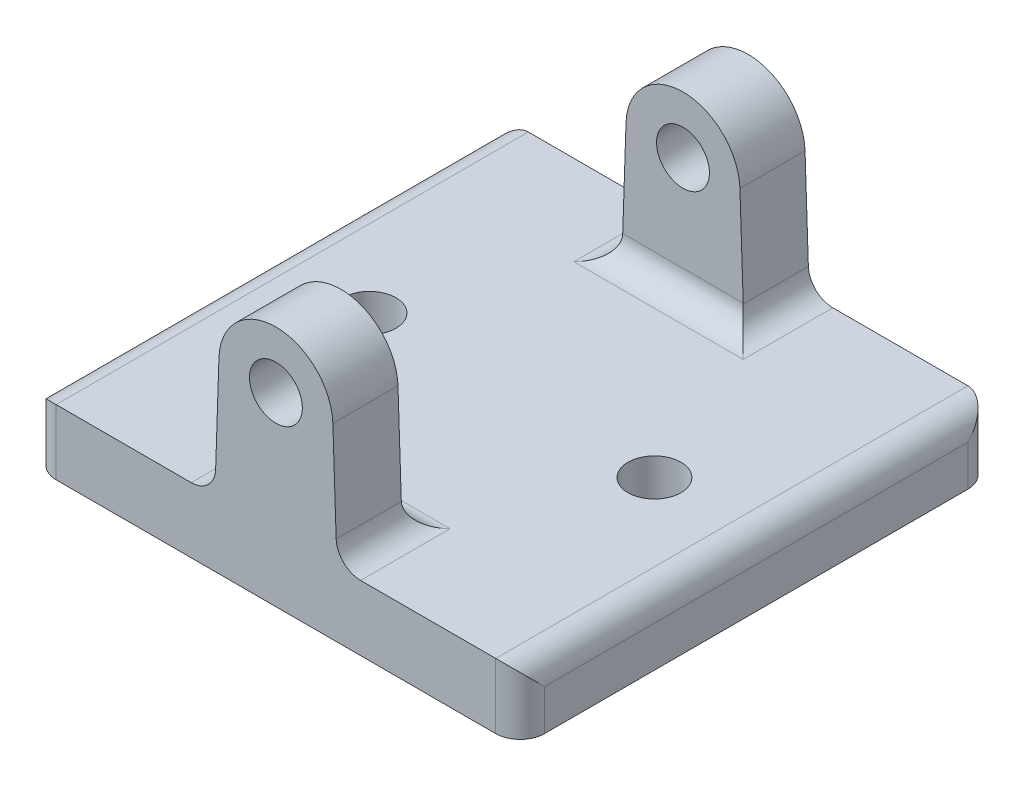
ISO-10303-21;
HEADER;
FILE_DESCRIPTION(('STEP AP214'),'2;1');
FILE_NAME('part.step','',(''),(''),'','','');
FILE_SCHEMA(('AUTOMOTIVE_DESIGN { 1 0 10303 214 1 1 1 1 }'));
ENDSEC;
DATA;
#1=APPLICATION_CONTEXT('core data for automotive mechanical design processes');
#2=APPLICATION_PROTOCOL_DEFINITION('international standard','automotive_design',2000,#1);
#3=PRODUCT_CONTEXT('',#1,'mechanical');
#4=PRODUCT('Part','Part','',(#3));
#5=PRODUCT_RELATED_PRODUCT_CATEGORY('part','',(#4));
#6=PRODUCT_DEFINITION_FORMATION('','',#4);
#7=PRODUCT_DEFINITION_CONTEXT('part definition',#1,'design');
#8=PRODUCT_DEFINITION('design','',#6,#7);
#9=PRODUCT_DEFINITION_SHAPE('','',#8);
#10=(LENGTH_UNIT() NAMED_UNIT(*) SI_UNIT(.MILLI.,.METRE.));
#11=(NAMED_UNIT(*) PLANE_ANGLE_UNIT() SI_UNIT($,.RADIAN.));
#12=(NAMED_UNIT(*) SI_UNIT($,.STERADIAN.) SOLID_ANGLE_UNIT());
#13=UNCERTAINTY_MEASURE_WITH_UNIT(LENGTH_MEASURE(1.E-05),#10,'distance_accuracy_value','');
#14=(GEOMETRIC_REPRESENTATION_CONTEXT(3) GLOBAL_UNCERTAINTY_ASSIGNED_CONTEXT((#13)) GLOBAL_UNIT_ASSIGNED_CONTEXT((#10,
#11,#12)) REPRESENTATION_CONTEXT('',''));
#15=CARTESIAN_POINT('',(0.,0.,0.));
#16=DIRECTION('',(0.,0.,1.));
#17=DIRECTION('',(1.,0.,0.));
#18=AXIS2_PLACEMENT_3D('',#15,#16,#17);
#19=CARTESIAN_POINT('',(0.,8.,0.));
#20=DIRECTION('',(0.,-1.,0.));
#21=DIRECTION('',(0.,0.,-1.));
#22=AXIS2_PLACEMENT_3D('',#19,#20,#21);
#23=PLANE('',#22);
#24=CARTESIAN_POINT('',(-17.5,8.,0.));
#25=DIRECTION('',(0.,1.,0.));
#26=DIRECTION('',(0.,0.,1.));
#27=AXIS2_PLACEMENT_3D('',#24,#25,#26);
#28=CIRCLE('',#27,3.25);
#29=CARTESIAN_POINT('',(-17.5,8.,3.25));
#30=VERTEX_POINT('',#29);
#31=EDGE_CURVE('E286',#30,#30,#28,.T.);
#32=ORIENTED_EDGE('',*,*,#31,.F.);
#33=EDGE_LOOP('',(#32));
#34=FACE_BOUND('',#33,.T.);
#35=CARTESIAN_POINT('',(17.5,8.,0.));
#36=DIRECTION('',(0.,1.,0.));
#37=DIRECTION('',(0.,0.,-1.));
#38=AXIS2_PLACEMENT_3D('',#35,#36,#37);
#39=CIRCLE('',#38,3.25);
#40=CARTESIAN_POINT('',(17.5,8.,-3.25));
#41=VERTEX_POINT('',#40);
#42=EDGE_CURVE('E278',#41,#41,#39,.T.);
#43=ORIENTED_EDGE('',*,*,#42,.F.);
#44=EDGE_LOOP('',(#43));
#45=FACE_BOUND('',#44,.T.);
#46=DIRECTION('',(1.,0.,0.));
#47=VECTOR('',#46,1.);
#48=CARTESIAN_POINT('',(-30.,8.,29.));
#49=LINE('',#48,#47);
#50=CARTESIAN_POINT('',(-27.,8.,29.));
#51=VERTEX_POINT('',#50);
#52=CARTESIAN_POINT('',(-10.4009031694853,8.,29.));
#53=VERTEX_POINT('',#52);
#54=EDGE_CURVE('E300',#51,#53,#49,.T.);
#55=ORIENTED_EDGE('',*,*,#54,.T.);
#56=DIRECTION('',(0.,0.,1.));
#57=VECTOR('',#56,1.);
#58=CARTESIAN_POINT('',(-10.4009031694853,8.,0.));
#59=LINE('',#58,#57);
#60=CARTESIAN_POINT('',(-10.4009031694853,8.,18.));
#61=VERTEX_POINT('',#60);
#62=EDGE_CURVE('E388',#53,#61,#59,.F.);
#63=ORIENTED_EDGE('',*,*,#62,.T.);
#64=DIRECTION('',(1.,0.,0.));
#65=VECTOR('',#64,1.);
#66=CARTESIAN_POINT('',(0.,8.,18.));
#67=LINE('',#66,#65);
#68=CARTESIAN_POINT('',(10.4009031694853,8.,18.));
#69=VERTEX_POINT('',#68);
#70=EDGE_CURVE('E384',#61,#69,#67,.T.);
#71=ORIENTED_EDGE('',*,*,#70,.T.);
#72=DIRECTION('',(0.,0.,1.));
#73=VECTOR('',#72,1.);
#74=CARTESIAN_POINT('',(10.4009031694853,8.,0.));
#75=LINE('',#74,#73);
#76=CARTESIAN_POINT('',(10.4009031694853,8.,29.));
#77=VERTEX_POINT('',#76);
#78=EDGE_CURVE('E381',#69,#77,#75,.T.);
#79=ORIENTED_EDGE('',*,*,#78,.T.);
#80=CARTESIAN_POINT('',(27.,8.,29.));
#81=VERTEX_POINT('',#80);
#82=EDGE_CURVE('E298',#77,#81,#49,.T.);
#83=ORIENTED_EDGE('',*,*,#82,.T.);
#84=DIRECTION('',(0.,0.,-1.));
#85=VECTOR('',#84,1.);
#86=CARTESIAN_POINT('',(27.,8.,0.));
#87=LINE('',#86,#85);
#88=CARTESIAN_POINT('',(27.,8.,-29.));
#89=VERTEX_POINT('',#88);
#90=EDGE_CURVE('E366',#81,#89,#87,.T.);
#91=ORIENTED_EDGE('',*,*,#90,.T.);
#92=DIRECTION('',(-1.,0.,0.));
#93=VECTOR('',#92,1.);
#94=CARTESIAN_POINT('',(-30.,8.,-29.));
#95=LINE('',#94,#93);
#96=CARTESIAN_POINT('',(10.4009031694853,8.,-29.));
#97=VERTEX_POINT('',#96);
#98=EDGE_CURVE('E294',#89,#97,#95,.T.);
#99=ORIENTED_EDGE('',*,*,#98,.T.);
#100=DIRECTION('',(0.,0.,-1.));
#101=VECTOR('',#100,1.);
#102=CARTESIAN_POINT('',(10.4009031694853,8.,-21.));
#103=LINE('',#102,#101);
#104=CARTESIAN_POINT('',(10.4009031694853,8.,-18.));
#105=VERTEX_POINT('',#104);
#106=EDGE_CURVE('E372',#97,#105,#103,.F.);
#107=ORIENTED_EDGE('',*,*,#106,.T.);
#108=DIRECTION('',(1.,0.,0.));
#109=VECTOR('',#108,1.);
#110=CARTESIAN_POINT('',(0.,8.,-18.));
#111=LINE('',#110,#109);
#112=CARTESIAN_POINT('',(-10.4009031694853,8.,-18.));
#113=VERTEX_POINT('',#112);
#114=EDGE_CURVE('E375',#105,#113,#111,.F.);
#115=ORIENTED_EDGE('',*,*,#114,.T.);
#116=DIRECTION('',(0.,0.,-1.));
#117=VECTOR('',#116,1.);
#118=CARTESIAN_POINT('',(-10.4009031694853,8.,-29.));
#119=LINE('',#118,#117);
#120=CARTESIAN_POINT('',(-10.4009031694853,8.,-29.));
#121=VERTEX_POINT('',#120);
#122=EDGE_CURVE('E378',#113,#121,#119,.T.);
#123=ORIENTED_EDGE('',*,*,#122,.T.);
#124=CARTESIAN_POINT('',(-27.,8.,-29.));
#125=VERTEX_POINT('',#124);
#126=EDGE_CURVE('E299',#121,#125,#95,.T.);
#127=ORIENTED_EDGE('',*,*,#126,.T.);
#128=DIRECTION('',(0.,0.,1.));
#129=VECTOR('',#128,1.);
#130=CARTESIAN_POINT('',(-27.,8.,0.));
#131=LINE('',#130,#129);
#132=EDGE_CURVE('E369',#125,#51,#131,.T.);
#133=ORIENTED_EDGE('',*,*,#132,.T.);
#134=EDGE_LOOP('',(#55,#63,#71,#79,#83,#91,#99,#107,#115,#123,#127,#133));
#135=FACE_BOUND('',#134,.T.);
#136=ADVANCED_FACE('F39',(#34,#45,#135),#23,.F.);
#137=CARTESIAN_POINT('',(0.,0.,0.));
#138=DIRECTION('',(0.,-1.,0.));
#139=DIRECTION('',(0.,0.,-1.));
#140=AXIS2_PLACEMENT_3D('',#137,#138,#139);
#141=PLANE('',#140);
#142=CARTESIAN_POINT('',(-17.5,0.,0.));
#143=DIRECTION('',(0.,1.,0.));
#144=DIRECTION('',(0.,0.,1.));
#145=AXIS2_PLACEMENT_3D('',#142,#143,#144);
#146=CIRCLE('',#145,3.25);
#147=CARTESIAN_POINT('',(-17.5,0.,3.25));
#148=VERTEX_POINT('',#147);
#149=EDGE_CURVE('E282',#148,#148,#146,.T.);
#150=ORIENTED_EDGE('',*,*,#149,.T.);
#151=EDGE_LOOP('',(#150));
#152=FACE_BOUND('',#151,.T.);
#153=DIRECTION('',(0.,0.,-1.));
#154=VECTOR('',#153,1.);
#155=CARTESIAN_POINT('',(30.,0.,29.));
#156=LINE('',#155,#154);
#157=CARTESIAN_POINT('',(30.,0.,26.));
#158=VERTEX_POINT('',#157);
#159=CARTESIAN_POINT('',(30.,0.,-26.));
#160=VERTEX_POINT('',#159);
#161=EDGE_CURVE('E290',#158,#160,#156,.T.);
#162=ORIENTED_EDGE('',*,*,#161,.F.);
#163=CARTESIAN_POINT('',(27.,0.,26.));
#164=DIRECTION('',(0.,-1.,0.));
#165=DIRECTION('',(0.,0.,-1.));
#166=AXIS2_PLACEMENT_3D('',#163,#164,#165);
#167=CIRCLE('',#166,3.);
#168=CARTESIAN_POINT('',(27.,0.,29.));
#169=VERTEX_POINT('',#168);
#170=EDGE_CURVE('E338',#158,#169,#167,.T.);
#171=ORIENTED_EDGE('',*,*,#170,.T.);
#172=DIRECTION('',(1.,0.,0.));
#173=VECTOR('',#172,1.);
#174=CARTESIAN_POINT('',(-30.,0.,29.));
#175=LINE('',#174,#173);
#176=CARTESIAN_POINT('',(-27.,0.,29.));
#177=VERTEX_POINT('',#176);
#178=EDGE_CURVE('E316',#177,#169,#175,.T.);
#179=ORIENTED_EDGE('',*,*,#178,.F.);
#180=CARTESIAN_POINT('',(-27.,0.,26.));
#181=DIRECTION('',(0.,-1.,0.));
#182=DIRECTION('',(0.,0.,-1.));
#183=AXIS2_PLACEMENT_3D('',#180,#181,#182);
#184=CIRCLE('',#183,3.);
#185=CARTESIAN_POINT('',(-30.,0.,26.));
#186=VERTEX_POINT('',#185);
#187=EDGE_CURVE('E335',#177,#186,#184,.T.);
#188=ORIENTED_EDGE('',*,*,#187,.T.);
#189=DIRECTION('',(0.,0.,1.));
#190=VECTOR('',#189,1.);
#191=CARTESIAN_POINT('',(-30.,0.,29.));
#192=LINE('',#191,#190);
#193=CARTESIAN_POINT('',(-30.,0.,-26.));
#194=VERTEX_POINT('',#193);
#195=EDGE_CURVE('E312',#194,#186,#192,.T.);
#196=ORIENTED_EDGE('',*,*,#195,.F.);
#197=CARTESIAN_POINT('',(-27.,0.,-26.));
#198=DIRECTION('',(0.,-1.,0.));
#199=DIRECTION('',(0.,0.,-1.));
#200=AXIS2_PLACEMENT_3D('',#197,#198,#199);
#201=CIRCLE('',#200,3.);
#202=CARTESIAN_POINT('',(-27.,0.,-29.));
#203=VERTEX_POINT('',#202);
#204=EDGE_CURVE('E332',#194,#203,#201,.T.);
#205=ORIENTED_EDGE('',*,*,#204,.T.);
#206=DIRECTION('',(-1.,0.,0.));
#207=VECTOR('',#206,1.);
#208=CARTESIAN_POINT('',(-30.,0.,-29.));
#209=LINE('',#208,#207);
#210=CARTESIAN_POINT('',(27.,0.,-29.));
#211=VERTEX_POINT('',#210);
#212=EDGE_CURVE('E308',#211,#203,#209,.T.);
#213=ORIENTED_EDGE('',*,*,#212,.F.);
#214=CARTESIAN_POINT('',(27.,0.,-26.));
#215=DIRECTION('',(0.,-1.,0.));
#216=DIRECTION('',(0.,0.,-1.));
#217=AXIS2_PLACEMENT_3D('',#214,#215,#216);
#218=CIRCLE('',#217,3.);
#219=EDGE_CURVE('E329',#211,#160,#218,.T.);
#220=ORIENTED_EDGE('',*,*,#219,.T.);
#221=EDGE_LOOP('',(#162,#171,#179,#188,#196,#205,#213,#220));
#222=FACE_BOUND('',#221,.T.);
#223=CARTESIAN_POINT('',(17.5,0.,0.));
#224=DIRECTION('',(0.,1.,0.));
#225=DIRECTION('',(0.,0.,-1.));
#226=AXIS2_PLACEMENT_3D('',#223,#224,#225);
#227=CIRCLE('',#226,3.25);
#228=CARTESIAN_POINT('',(17.5,0.,-3.25));
#229=VERTEX_POINT('',#228);
#230=EDGE_CURVE('E274',#229,#229,#227,.T.);
#231=ORIENTED_EDGE('',*,*,#230,.T.);
#232=EDGE_LOOP('',(#231));
#233=FACE_BOUND('',#232,.T.);
#234=ADVANCED_FACE('F478',(#152,#222,#233),#141,.T.);
#235=CARTESIAN_POINT('',(30.,8.,29.));
#236=DIRECTION('',(-1.,0.,0.));
#237=DIRECTION('',(0.,0.,1.));
#238=AXIS2_PLACEMENT_3D('',#235,#236,#237);
#239=PLANE('',#238);
#240=DIRECTION('',(0.,0.,-1.));
#241=VECTOR('',#240,1.);
#242=CARTESIAN_POINT('',(30.,5.,29.));
#243=LINE('',#242,#241);
#244=CARTESIAN_POINT('',(30.,5.,-26.));
#245=VERTEX_POINT('',#244);
#246=CARTESIAN_POINT('',(30.,5.,26.));
#247=VERTEX_POINT('',#246);
#248=EDGE_CURVE('E304',#245,#247,#243,.F.);
#249=ORIENTED_EDGE('',*,*,#248,.T.);
#250=DIRECTION('',(0.,-1.,0.));
#251=VECTOR('',#250,1.);
#252=CARTESIAN_POINT('',(30.,8.,26.));
#253=LINE('',#252,#251);
#254=EDGE_CURVE('E325',#247,#158,#253,.T.);
#255=ORIENTED_EDGE('',*,*,#254,.T.);
#256=ORIENTED_EDGE('',*,*,#161,.T.);
#257=DIRECTION('',(0.,-1.,0.));
#258=VECTOR('',#257,1.);
#259=CARTESIAN_POINT('',(30.,8.,-26.));
#260=LINE('',#259,#258);
#261=EDGE_CURVE('E322',#160,#245,#260,.F.);
#262=ORIENTED_EDGE('',*,*,#261,.T.);
#263=EDGE_LOOP('',(#249,#255,#256,#262));
#264=FACE_BOUND('',#263,.T.);
#265=ADVANCED_FACE('F507',(#264),#239,.F.);
#266=CARTESIAN_POINT('',(-30.,8.,-29.));
#267=DIRECTION('',(0.,0.,1.));
#268=DIRECTION('',(1.,0.,0.));
#269=AXIS2_PLACEMENT_3D('',#266,#267,#268);
#270=PLANE('',#269);
#271=ORIENTED_EDGE('',*,*,#212,.T.);
#272=DIRECTION('',(0.,-1.,0.));
#273=VECTOR('',#272,1.);
#274=CARTESIAN_POINT('',(-27.,8.,-29.));
#275=LINE('',#274,#273);
#276=EDGE_CURVE('E360',#203,#125,#275,.F.);
#277=ORIENTED_EDGE('',*,*,#276,.T.);
#278=ORIENTED_EDGE('',*,*,#126,.F.);
#279=CARTESIAN_POINT('',(-10.4009031694853,11.,-29.));
#280=DIRECTION('',(0.,0.,1.));
#281=DIRECTION('',(1.,0.,0.));
#282=AXIS2_PLACEMENT_3D('',#279,#280,#281);
#283=CIRCLE('',#282,3.);
#284=CARTESIAN_POINT('',(-7.40259482270454,10.8992673954235,-29.));
#285=VERTEX_POINT('',#284);
#286=EDGE_CURVE('E49',#121,#285,#283,.T.);
#287=ORIENTED_EDGE('',*,*,#286,.T.);
#288=DIRECTION('',(-0.0335775348588195,-0.99943611559359,0.));
#289=VECTOR('',#288,1.);
#290=CARTESIAN_POINT('',(-7.49999999999999,8.,-29.));
#291=LINE('',#290,#289);
#292=CARTESIAN_POINT('',(-6.99605280915513,23.,-29.));
#293=VERTEX_POINT('',#292);
#294=EDGE_CURVE('E232',#293,#285,#291,.T.);
#295=ORIENTED_EDGE('',*,*,#294,.F.);
#296=CARTESIAN_POINT('',(0.,22.7649572559883,-29.));
#297=DIRECTION('',(0.,0.,1.));
#298=DIRECTION('',(-1.,0.,0.));
#299=AXIS2_PLACEMENT_3D('',#296,#297,#298);
#300=CIRCLE('',#299,7.);
#301=CARTESIAN_POINT('',(6.99605280915514,23.,-29.));
#302=VERTEX_POINT('',#301);
#303=EDGE_CURVE('E211',#302,#293,#300,.T.);
#304=ORIENTED_EDGE('',*,*,#303,.F.);
#305=DIRECTION('',(-0.0335775348588197,0.99943611559359,0.));
#306=VECTOR('',#305,1.);
#307=CARTESIAN_POINT('',(6.99605280915514,23.,-29.));
#308=LINE('',#307,#306);
#309=CARTESIAN_POINT('',(7.40259482270455,10.8992673954235,-29.));
#310=VERTEX_POINT('',#309);
#311=EDGE_CURVE('E222',#310,#302,#308,.T.);
#312=ORIENTED_EDGE('',*,*,#311,.F.);
#313=CARTESIAN_POINT('',(10.4009031694853,11.,-29.));
#314=DIRECTION('',(0.,0.,1.));
#315=DIRECTION('',(1.,0.,0.));
#316=AXIS2_PLACEMENT_3D('',#313,#314,#315);
#317=CIRCLE('',#316,3.);
#318=EDGE_CURVE('E11',#310,#97,#317,.T.);
#319=ORIENTED_EDGE('',*,*,#318,.T.);
#320=ORIENTED_EDGE('',*,*,#98,.F.);
#321=DIRECTION('',(0.,-1.,0.));
#322=VECTOR('',#321,1.);
#323=CARTESIAN_POINT('',(27.,8.,-29.));
#324=LINE('',#323,#322);
#325=EDGE_CURVE('E357',#89,#211,#324,.T.);
#326=ORIENTED_EDGE('',*,*,#325,.T.);
#327=EDGE_LOOP('',(#271,#277,#278,#287,#295,#304,#312,#319,#320,#326));
#328=FACE_BOUND('',#327,.T.);
#329=CARTESIAN_POINT('',(0.,22.7649572559883,-29.));
#330=DIRECTION('',(0.,0.,1.));
#331=DIRECTION('',(1.,0.,0.));
#332=AXIS2_PLACEMENT_3D('',#329,#330,#331);
#333=CIRCLE('',#332,3.25);
#334=CARTESIAN_POINT('',(3.25000000000001,22.7649572559883,-29.));
#335=VERTEX_POINT('',#334);
#336=EDGE_CURVE('E227',#335,#335,#333,.T.);
#337=ORIENTED_EDGE('',*,*,#336,.T.);
#338=EDGE_LOOP('',(#337));
#339=FACE_BOUND('',#338,.T.);
#340=ADVANCED_FACE('F491',(#328,#339),#270,.F.);
#341=CARTESIAN_POINT('',(-30.,8.,29.));
#342=DIRECTION('',(1.,0.,0.));
#343=DIRECTION('',(0.,0.,-1.));
#344=AXIS2_PLACEMENT_3D('',#341,#342,#343);
#345=PLANE('',#344);
#346=ORIENTED_EDGE('',*,*,#195,.T.);
#347=DIRECTION('',(0.,-1.,0.));
#348=VECTOR('',#347,1.);
#349=CARTESIAN_POINT('',(-30.,8.,26.));
#350=LINE('',#349,#348);
#351=CARTESIAN_POINT('',(-30.,5.,26.));
#352=VERTEX_POINT('',#351);
#353=EDGE_CURVE('E354',#186,#352,#350,.F.);
#354=ORIENTED_EDGE('',*,*,#353,.T.);
#355=DIRECTION('',(0.,0.,1.));
#356=VECTOR('',#355,1.);
#357=CARTESIAN_POINT('',(-30.,5.,29.));
#358=LINE('',#357,#356);
#359=CARTESIAN_POINT('',(-30.,5.,-26.));
#360=VERTEX_POINT('',#359);
#361=EDGE_CURVE('E348',#352,#360,#358,.F.);
#362=ORIENTED_EDGE('',*,*,#361,.T.);
#363=DIRECTION('',(0.,-1.,0.));
#364=VECTOR('',#363,1.);
#365=CARTESIAN_POINT('',(-30.,8.,-26.));
#366=LINE('',#365,#364);
#367=EDGE_CURVE('E351',#360,#194,#366,.T.);
#368=ORIENTED_EDGE('',*,*,#367,.T.);
#369=EDGE_LOOP('',(#346,#354,#362,#368));
#370=FACE_BOUND('',#369,.T.);
#371=ADVANCED_FACE('F482',(#370),#345,.F.);
#372=CARTESIAN_POINT('',(-30.,8.,29.));
#373=DIRECTION('',(0.,0.,-1.));
#374=DIRECTION('',(-1.,0.,0.));
#375=AXIS2_PLACEMENT_3D('',#372,#373,#374);
#376=PLANE('',#375);
#377=ORIENTED_EDGE('',*,*,#178,.T.);
#378=DIRECTION('',(0.,-1.,0.));
#379=VECTOR('',#378,1.);
#380=CARTESIAN_POINT('',(27.,8.,29.));
#381=LINE('',#380,#379);
#382=EDGE_CURVE('E345',#169,#81,#381,.F.);
#383=ORIENTED_EDGE('',*,*,#382,.T.);
#384=ORIENTED_EDGE('',*,*,#82,.F.);
#385=CARTESIAN_POINT('',(10.4009031694853,11.,29.));
#386=DIRECTION('',(0.,0.,-1.));
#387=DIRECTION('',(-1.,0.,0.));
#388=AXIS2_PLACEMENT_3D('',#385,#386,#387);
#389=CIRCLE('',#388,3.);
#390=CARTESIAN_POINT('',(7.40259482270455,10.8992673954235,29.));
#391=VERTEX_POINT('',#390);
#392=EDGE_CURVE('E419',#77,#391,#389,.T.);
#393=ORIENTED_EDGE('',*,*,#392,.T.);
#394=DIRECTION('',(-0.0335775348588197,0.99943611559359,0.));
#395=VECTOR('',#394,1.);
#396=CARTESIAN_POINT('',(6.99605280915514,23.,29.));
#397=LINE('',#396,#395);
#398=CARTESIAN_POINT('',(6.99605280915514,23.,29.));
#399=VERTEX_POINT('',#398);
#400=EDGE_CURVE('E245',#391,#399,#397,.T.);
#401=ORIENTED_EDGE('',*,*,#400,.T.);
#402=CARTESIAN_POINT('',(0.,22.7649572559883,29.));
#403=DIRECTION('',(0.,0.,1.));
#404=DIRECTION('',(-1.,0.,0.));
#405=AXIS2_PLACEMENT_3D('',#402,#403,#404);
#406=CIRCLE('',#405,7.);
#407=CARTESIAN_POINT('',(-6.99605280915513,23.,29.));
#408=VERTEX_POINT('',#407);
#409=EDGE_CURVE('E264',#399,#408,#406,.T.);
#410=ORIENTED_EDGE('',*,*,#409,.T.);
#411=DIRECTION('',(-0.0335775348588195,-0.99943611559359,0.));
#412=VECTOR('',#411,1.);
#413=CARTESIAN_POINT('',(-7.49999999999999,8.,29.));
#414=LINE('',#413,#412);
#415=CARTESIAN_POINT('',(-7.40259482270454,10.8992673954235,29.));
#416=VERTEX_POINT('',#415);
#417=EDGE_CURVE('E253',#408,#416,#414,.T.);
#418=ORIENTED_EDGE('',*,*,#417,.T.);
#419=CARTESIAN_POINT('',(-10.4009031694853,11.,29.));
#420=DIRECTION('',(0.,0.,-1.));
#421=DIRECTION('',(-1.,0.,0.));
#422=AXIS2_PLACEMENT_3D('',#419,#420,#421);
#423=CIRCLE('',#422,3.);
#424=EDGE_CURVE('E416',#416,#53,#423,.T.);
#425=ORIENTED_EDGE('',*,*,#424,.T.);
#426=ORIENTED_EDGE('',*,*,#54,.F.);
#427=DIRECTION('',(0.,-1.,0.));
#428=VECTOR('',#427,1.);
#429=CARTESIAN_POINT('',(-27.,8.,29.));
#430=LINE('',#429,#428);
#431=EDGE_CURVE('E341',#51,#177,#430,.T.);
#432=ORIENTED_EDGE('',*,*,#431,.T.);
#433=EDGE_LOOP('',(#377,#383,#384,#393,#401,#410,#418,#425,#426,#432));
#434=FACE_BOUND('',#433,.T.);
#435=CARTESIAN_POINT('',(0.,22.7649572559883,29.));
#436=DIRECTION('',(0.,0.,1.));
#437=DIRECTION('',(1.,0.,0.));
#438=AXIS2_PLACEMENT_3D('',#435,#436,#437);
#439=CIRCLE('',#438,3.25);
#440=CARTESIAN_POINT('',(3.25000000000001,22.7649572559883,29.));
#441=VERTEX_POINT('',#440);
#442=EDGE_CURVE('E239',#441,#441,#439,.T.);
#443=ORIENTED_EDGE('',*,*,#442,.F.);
#444=EDGE_LOOP('',(#443));
#445=FACE_BOUND('',#444,.T.);
#446=ADVANCED_FACE('F465',(#434,#445),#376,.F.);
#447=CARTESIAN_POINT('',(-17.5,8.,0.));
#448=DIRECTION('',(0.,-1.,0.));
#449=DIRECTION('',(0.,0.,-1.));
#450=AXIS2_PLACEMENT_3D('',#447,#448,#449);
#451=CYLINDRICAL_SURFACE('',#450,3.25);
#452=ORIENTED_EDGE('',*,*,#31,.T.);
#453=EDGE_LOOP('',(#452));
#454=FACE_BOUND('',#453,.T.);
#455=ORIENTED_EDGE('',*,*,#149,.F.);
#456=EDGE_LOOP('',(#455));
#457=FACE_BOUND('',#456,.T.);
#458=ADVANCED_FACE('F533',(#454,#457),#451,.F.);
#459=CARTESIAN_POINT('',(17.5,8.,0.));
#460=DIRECTION('',(0.,-1.,0.));
#461=DIRECTION('',(0.,0.,-1.));
#462=AXIS2_PLACEMENT_3D('',#459,#460,#461);
#463=CYLINDRICAL_SURFACE('',#462,3.25);
#464=ORIENTED_EDGE('',*,*,#42,.T.);
#465=EDGE_LOOP('',(#464));
#466=FACE_BOUND('',#465,.T.);
#467=ORIENTED_EDGE('',*,*,#230,.F.);
#468=EDGE_LOOP('',(#467));
#469=FACE_BOUND('',#468,.T.);
#470=ADVANCED_FACE('F565',(#466,#469),#463,.F.);
#471=CARTESIAN_POINT('',(-7.49999999999999,8.,21.));
#472=DIRECTION('',(-0.99943611559359,0.0335775348588195,0.));
#473=DIRECTION('',(-0.0335775348588195,-0.99943611559359,0.));
#474=AXIS2_PLACEMENT_3D('',#471,#472,#473);
#475=PLANE('',#474);
#476=CARTESIAN_POINT('',(-7.39921056183102,11.,18.));
#477=DIRECTION('',(-0.99943611559359,0.0335775348588195,0.));
#478=DIRECTION('',(0.0335775348588195,0.99943611559359,0.));
#479=AXIS2_PLACEMENT_3D('',#476,#477,#478);
#480=ELLIPSE('',#479,3.00169260765429,3.);
#481=CARTESIAN_POINT('',(-7.39921056183102,11.,21.));
#482=VERTEX_POINT('',#481);
#483=CARTESIAN_POINT('',(-7.40259482270454,10.8992673954235,20.9983083467808));
#484=VERTEX_POINT('',#483);
#485=EDGE_CURVE('E413',#482,#484,#480,.F.);
#486=ORIENTED_EDGE('',*,*,#485,.T.);
#487=DIRECTION('',(0.,0.,1.));
#488=VECTOR('',#487,1.);
#489=CARTESIAN_POINT('',(-7.40259482270454,10.8992673954235,21.));
#490=LINE('',#489,#488);
#491=EDGE_CURVE('E57',#484,#416,#490,.T.);
#492=ORIENTED_EDGE('',*,*,#491,.T.);
#493=ORIENTED_EDGE('',*,*,#417,.F.);
#494=DIRECTION('',(0.,0.,1.));
#495=VECTOR('',#494,1.);
#496=CARTESIAN_POINT('',(-6.99605280915513,23.,21.));
#497=LINE('',#496,#495);
#498=CARTESIAN_POINT('',(-6.99605280915513,23.,21.));
#499=VERTEX_POINT('',#498);
#500=EDGE_CURVE('E271',#499,#408,#497,.T.);
#501=ORIENTED_EDGE('',*,*,#500,.F.);
#502=DIRECTION('',(-0.0335775348588195,-0.99943611559359,0.));
#503=VECTOR('',#502,1.);
#504=CARTESIAN_POINT('',(-7.49999999999999,8.,21.));
#505=LINE('',#504,#503);
#506=EDGE_CURVE('E257',#499,#482,#505,.T.);
#507=ORIENTED_EDGE('',*,*,#506,.T.);
#508=EDGE_LOOP('',(#486,#492,#493,#501,#507));
#509=FACE_BOUND('',#508,.T.);
#510=ADVANCED_FACE('F572',(#509),#475,.T.);
#511=CARTESIAN_POINT('',(0.,22.7649572559883,21.));
#512=DIRECTION('',(0.,0.,1.));
#513=DIRECTION('',(1.,0.,0.));
#514=AXIS2_PLACEMENT_3D('',#511,#512,#513);
#515=CYLINDRICAL_SURFACE('',#514,7.);
#516=ORIENTED_EDGE('',*,*,#409,.F.);
#517=DIRECTION('',(0.,0.,1.));
#518=VECTOR('',#517,1.);
#519=CARTESIAN_POINT('',(6.99605280915514,23.,21.));
#520=LINE('',#519,#518);
#521=CARTESIAN_POINT('',(6.99605280915514,23.,21.));
#522=VERTEX_POINT('',#521);
#523=EDGE_CURVE('E261',#522,#399,#520,.T.);
#524=ORIENTED_EDGE('',*,*,#523,.F.);
#525=CARTESIAN_POINT('',(0.,22.7649572559883,21.));
#526=DIRECTION('',(0.,0.,1.));
#527=DIRECTION('',(-1.,0.,0.));
#528=AXIS2_PLACEMENT_3D('',#525,#526,#527);
#529=CIRCLE('',#528,7.);
#530=EDGE_CURVE('E252',#522,#499,#529,.T.);
#531=ORIENTED_EDGE('',*,*,#530,.T.);
#532=ORIENTED_EDGE('',*,*,#500,.T.);
#533=EDGE_LOOP('',(#516,#524,#531,#532));
#534=FACE_BOUND('',#533,.T.);
#535=ADVANCED_FACE('F579',(#534),#515,.T.);
#536=CARTESIAN_POINT('',(6.99605280915514,23.,21.));
#537=DIRECTION('',(0.99943611559359,0.0335775348588197,0.));
#538=DIRECTION('',(-0.0335775348588197,0.99943611559359,0.));
#539=AXIS2_PLACEMENT_3D('',#536,#537,#538);
#540=PLANE('',#539);
#541=ORIENTED_EDGE('',*,*,#400,.F.);
#542=DIRECTION('',(0.,0.,1.));
#543=VECTOR('',#542,1.);
#544=CARTESIAN_POINT('',(7.40259482270455,10.8992673954235,21.));
#545=LINE('',#544,#543);
#546=CARTESIAN_POINT('',(7.40259482270455,10.8992673954235,20.9983083467808));
#547=VERTEX_POINT('',#546);
#548=EDGE_CURVE('E65',#391,#547,#545,.F.);
#549=ORIENTED_EDGE('',*,*,#548,.T.);
#550=CARTESIAN_POINT('',(7.39921056183104,11.,18.));
#551=DIRECTION('',(0.99943611559359,0.0335775348588197,0.));
#552=DIRECTION('',(0.0335775348588197,-0.99943611559359,0.));
#553=AXIS2_PLACEMENT_3D('',#550,#551,#552);
#554=ELLIPSE('',#553,3.00169260765429,3.);
#555=CARTESIAN_POINT('',(7.39921056183104,11.,21.));
#556=VERTEX_POINT('',#555);
#557=EDGE_CURVE('E410',#547,#556,#554,.F.);
#558=ORIENTED_EDGE('',*,*,#557,.T.);
#559=DIRECTION('',(-0.0335775348588197,0.99943611559359,0.));
#560=VECTOR('',#559,1.);
#561=CARTESIAN_POINT('',(6.99605280915514,23.,21.));
#562=LINE('',#561,#560);
#563=EDGE_CURVE('E249',#556,#522,#562,.T.);
#564=ORIENTED_EDGE('',*,*,#563,.T.);
#565=ORIENTED_EDGE('',*,*,#523,.T.);
#566=EDGE_LOOP('',(#541,#549,#558,#564,#565));
#567=FACE_BOUND('',#566,.T.);
#568=ADVANCED_FACE('F587',(#567),#540,.T.);
#569=CARTESIAN_POINT('',(0.,22.7649572559883,21.));
#570=DIRECTION('',(0.,0.,-1.));
#571=DIRECTION('',(-1.,0.,0.));
#572=AXIS2_PLACEMENT_3D('',#569,#570,#571);
#573=PLANE('',#572);
#574=CARTESIAN_POINT('',(0.,22.7649572559883,21.));
#575=DIRECTION('',(0.,0.,1.));
#576=DIRECTION('',(1.,0.,0.));
#577=AXIS2_PLACEMENT_3D('',#574,#575,#576);
#578=CIRCLE('',#577,3.25);
#579=CARTESIAN_POINT('',(3.25000000000001,22.7649572559883,21.));
#580=VERTEX_POINT('',#579);
#581=EDGE_CURVE('E241',#580,#580,#578,.T.);
#582=ORIENTED_EDGE('',*,*,#581,.T.);
#583=EDGE_LOOP('',(#582));
#584=FACE_BOUND('',#583,.T.);
#585=ORIENTED_EDGE('',*,*,#563,.F.);
#586=DIRECTION('',(1.,0.,0.));
#587=VECTOR('',#586,1.);
#588=CARTESIAN_POINT('',(0.,11.,21.));
#589=LINE('',#588,#587);
#590=EDGE_CURVE('E391',#556,#482,#589,.F.);
#591=ORIENTED_EDGE('',*,*,#590,.T.);
#592=ORIENTED_EDGE('',*,*,#506,.F.);
#593=ORIENTED_EDGE('',*,*,#530,.F.);
#594=EDGE_LOOP('',(#585,#591,#592,#593));
#595=FACE_BOUND('',#594,.T.);
#596=ADVANCED_FACE('F595',(#584,#595),#573,.T.);
#597=CARTESIAN_POINT('',(0.,22.7649572559883,21.));
#598=DIRECTION('',(0.,0.,1.));
#599=DIRECTION('',(1.,0.,0.));
#600=AXIS2_PLACEMENT_3D('',#597,#598,#599);
#601=CYLINDRICAL_SURFACE('',#600,3.25);
#602=ORIENTED_EDGE('',*,*,#581,.F.);
#603=EDGE_LOOP('',(#602));
#604=FACE_BOUND('',#603,.T.);
#605=ORIENTED_EDGE('',*,*,#442,.T.);
#606=EDGE_LOOP('',(#605));
#607=FACE_BOUND('',#606,.T.);
#608=ADVANCED_FACE('F602',(#604,#607),#601,.F.);
#609=CARTESIAN_POINT('',(0.,22.7649572559883,-21.));
#610=DIRECTION('',(0.,0.,1.));
#611=DIRECTION('',(-1.,0.,0.));
#612=AXIS2_PLACEMENT_3D('',#609,#610,#611);
#613=PLANE('',#612);
#614=DIRECTION('',(-0.0335775348588195,-0.99943611559359,0.));
#615=VECTOR('',#614,1.);
#616=CARTESIAN_POINT('',(-7.49999999999999,8.,-21.));
#617=LINE('',#616,#615);
#618=CARTESIAN_POINT('',(-6.99605280915513,23.,-21.));
#619=VERTEX_POINT('',#618);
#620=CARTESIAN_POINT('',(-7.39921056183102,11.,-21.));
#621=VERTEX_POINT('',#620);
#622=EDGE_CURVE('E198',#619,#621,#617,.T.);
#623=ORIENTED_EDGE('',*,*,#622,.T.);
#624=DIRECTION('',(1.,0.,0.));
#625=VECTOR('',#624,1.);
#626=CARTESIAN_POINT('',(0.,11.,-21.));
#627=LINE('',#626,#625);
#628=CARTESIAN_POINT('',(7.39921056183104,11.,-21.));
#629=VERTEX_POINT('',#628);
#630=EDGE_CURVE('E363',#621,#629,#627,.T.);
#631=ORIENTED_EDGE('',*,*,#630,.T.);
#632=DIRECTION('',(-0.0335775348588197,0.99943611559359,0.));
#633=VECTOR('',#632,1.);
#634=CARTESIAN_POINT('',(6.99605280915514,23.,-21.));
#635=LINE('',#634,#633);
#636=CARTESIAN_POINT('',(6.99605280915514,23.,-21.));
#637=VERTEX_POINT('',#636);
#638=EDGE_CURVE('E201',#629,#637,#635,.T.);
#639=ORIENTED_EDGE('',*,*,#638,.T.);
#640=CARTESIAN_POINT('',(0.,22.7649572559883,-21.));
#641=DIRECTION('',(0.,0.,1.));
#642=DIRECTION('',(-1.,0.,0.));
#643=AXIS2_PLACEMENT_3D('',#640,#641,#642);
#644=CIRCLE('',#643,7.);
#645=EDGE_CURVE('E192',#637,#619,#644,.T.);
#646=ORIENTED_EDGE('',*,*,#645,.T.);
#647=EDGE_LOOP('',(#623,#631,#639,#646));
#648=FACE_BOUND('',#647,.T.);
#649=CARTESIAN_POINT('',(0.,22.7649572559883,-21.));
#650=DIRECTION('',(0.,0.,1.));
#651=DIRECTION('',(1.,0.,0.));
#652=AXIS2_PLACEMENT_3D('',#649,#650,#651);
#653=CIRCLE('',#652,3.25);
#654=CARTESIAN_POINT('',(3.25000000000001,22.7649572559883,-21.));
#655=VERTEX_POINT('',#654);
#656=EDGE_CURVE('E235',#655,#655,#653,.T.);
#657=ORIENTED_EDGE('',*,*,#656,.F.);
#658=EDGE_LOOP('',(#657));
#659=FACE_BOUND('',#658,.T.);
#660=ADVANCED_FACE('F194',(#648,#659),#613,.T.);
#661=CARTESIAN_POINT('',(6.99605280915514,23.,-21.));
#662=DIRECTION('',(-0.99943611559359,-0.0335775348588197,0.));
#663=DIRECTION('',(0.0335775348588197,-0.99943611559359,0.));
#664=AXIS2_PLACEMENT_3D('',#661,#662,#663);
#665=PLANE('',#664);
#666=CARTESIAN_POINT('',(7.39921056183104,11.,-18.));
#667=DIRECTION('',(-0.99943611559359,-0.0335775348588197,0.));
#668=DIRECTION('',(0.0335775348588197,-0.99943611559359,0.));
#669=AXIS2_PLACEMENT_3D('',#666,#667,#668);
#670=ELLIPSE('',#669,3.00169260765429,3.);
#671=CARTESIAN_POINT('',(7.40259482270455,10.8992673954235,-20.9983083467808));
#672=VERTEX_POINT('',#671);
#673=EDGE_CURVE('E404',#629,#672,#670,.T.);
#674=ORIENTED_EDGE('',*,*,#673,.T.);
#675=DIRECTION('',(0.,0.,-1.));
#676=VECTOR('',#675,1.);
#677=CARTESIAN_POINT('',(7.40259482270455,10.8992673954235,-29.));
#678=LINE('',#677,#676);
#679=EDGE_CURVE('E401',#672,#310,#678,.T.);
#680=ORIENTED_EDGE('',*,*,#679,.T.);
#681=ORIENTED_EDGE('',*,*,#311,.T.);
#682=DIRECTION('',(0.,0.,-1.));
#683=VECTOR('',#682,1.);
#684=CARTESIAN_POINT('',(6.99605280915514,23.,-21.));
#685=LINE('',#684,#683);
#686=EDGE_CURVE('E216',#637,#302,#685,.T.);
#687=ORIENTED_EDGE('',*,*,#686,.F.);
#688=ORIENTED_EDGE('',*,*,#638,.F.);
#689=EDGE_LOOP('',(#674,#680,#681,#687,#688));
#690=FACE_BOUND('',#689,.T.);
#691=ADVANCED_FACE('F617',(#690),#665,.F.);
#692=CARTESIAN_POINT('',(0.,22.7649572559883,-21.));
#693=DIRECTION('',(0.,0.,-1.));
#694=DIRECTION('',(-1.,0.,0.));
#695=AXIS2_PLACEMENT_3D('',#692,#693,#694);
#696=CYLINDRICAL_SURFACE('',#695,7.);
#697=ORIENTED_EDGE('',*,*,#303,.T.);
#698=DIRECTION('',(0.,0.,-1.));
#699=VECTOR('',#698,1.);
#700=CARTESIAN_POINT('',(-6.99605280915513,23.,-21.));
#701=LINE('',#700,#699);
#702=EDGE_CURVE('E208',#619,#293,#701,.T.);
#703=ORIENTED_EDGE('',*,*,#702,.F.);
#704=ORIENTED_EDGE('',*,*,#645,.F.);
#705=ORIENTED_EDGE('',*,*,#686,.T.);
#706=EDGE_LOOP('',(#697,#703,#704,#705));
#707=FACE_BOUND('',#706,.T.);
#708=ADVANCED_FACE('F209',(#707),#696,.T.);
#709=CARTESIAN_POINT('',(-7.49999999999999,8.,-21.));
#710=DIRECTION('',(0.99943611559359,-0.0335775348588195,0.));
#711=DIRECTION('',(0.0335775348588195,0.99943611559359,0.));
#712=AXIS2_PLACEMENT_3D('',#709,#710,#711);
#713=PLANE('',#712);
#714=ORIENTED_EDGE('',*,*,#294,.T.);
#715=DIRECTION('',(0.,0.,-1.));
#716=VECTOR('',#715,1.);
#717=CARTESIAN_POINT('',(-7.40259482270454,10.8992673954235,-21.));
#718=LINE('',#717,#716);
#719=CARTESIAN_POINT('',(-7.40259482270454,10.8992673954235,-20.9983083467808));
#720=VERTEX_POINT('',#719);
#721=EDGE_CURVE('E398',#285,#720,#718,.F.);
#722=ORIENTED_EDGE('',*,*,#721,.T.);
#723=CARTESIAN_POINT('',(-7.39921056183102,11.,-18.));
#724=DIRECTION('',(0.99943611559359,-0.0335775348588195,0.));
#725=DIRECTION('',(0.0335775348588195,0.99943611559359,0.));
#726=AXIS2_PLACEMENT_3D('',#723,#724,#725);
#727=ELLIPSE('',#726,3.00169260765429,3.);
#728=EDGE_CURVE('E220',#720,#621,#727,.T.);
#729=ORIENTED_EDGE('',*,*,#728,.T.);
#730=ORIENTED_EDGE('',*,*,#622,.F.);
#731=ORIENTED_EDGE('',*,*,#702,.T.);
#732=EDGE_LOOP('',(#714,#722,#729,#730,#731));
#733=FACE_BOUND('',#732,.T.);
#734=ADVANCED_FACE('F218',(#733),#713,.F.);
#735=CARTESIAN_POINT('',(0.,22.7649572559883,-21.));
#736=DIRECTION('',(0.,0.,-1.));
#737=DIRECTION('',(-1.,0.,0.));
#738=AXIS2_PLACEMENT_3D('',#735,#736,#737);
#739=CYLINDRICAL_SURFACE('',#738,3.25);
#740=ORIENTED_EDGE('',*,*,#656,.T.);
#741=EDGE_LOOP('',(#740));
#742=FACE_BOUND('',#741,.T.);
#743=ORIENTED_EDGE('',*,*,#336,.F.);
#744=EDGE_LOOP('',(#743));
#745=FACE_BOUND('',#744,.T.);
#746=ADVANCED_FACE('F637',(#742,#745),#739,.F.);
#747=CARTESIAN_POINT('',(27.,8.,-26.));
#748=DIRECTION('',(0.,-1.,0.));
#749=DIRECTION('',(0.,0.,-1.));
#750=AXIS2_PLACEMENT_3D('',#747,#748,#749);
#751=CYLINDRICAL_SURFACE('',#750,3.);
#752=ORIENTED_EDGE('',*,*,#219,.F.);
#753=ORIENTED_EDGE('',*,*,#325,.F.);
#754=CARTESIAN_POINT('',(27.,5.,-26.));
#755=DIRECTION('',(0.,-0.707106781186547,-0.707106781186547));
#756=DIRECTION('',(0.,0.707106781186547,-0.707106781186547));
#757=AXIS2_PLACEMENT_3D('',#754,#755,#756);
#758=ELLIPSE('',#757,4.24264068711928,3.);
#759=EDGE_CURVE('E428',#245,#89,#758,.F.);
#760=ORIENTED_EDGE('',*,*,#759,.F.);
#761=ORIENTED_EDGE('',*,*,#261,.F.);
#762=EDGE_LOOP('',(#752,#753,#760,#761));
#763=FACE_BOUND('',#762,.T.);
#764=ADVANCED_FACE('F498',(#763),#751,.T.);
#765=CARTESIAN_POINT('',(27.,5.,0.));
#766=DIRECTION('',(0.,0.,-1.));
#767=DIRECTION('',(-1.,0.,0.));
#768=AXIS2_PLACEMENT_3D('',#765,#766,#767);
#769=CYLINDRICAL_SURFACE('',#768,3.);
#770=ORIENTED_EDGE('',*,*,#759,.T.);
#771=ORIENTED_EDGE('',*,*,#90,.F.);
#772=CARTESIAN_POINT('',(27.,5.,26.));
#773=DIRECTION('',(0.,0.707106781186547,-0.707106781186547));
#774=DIRECTION('',(0.,-0.707106781186547,-0.707106781186547));
#775=AXIS2_PLACEMENT_3D('',#772,#773,#774);
#776=ELLIPSE('',#775,4.24264068711928,3.);
#777=EDGE_CURVE('E424',#247,#81,#776,.F.);
#778=ORIENTED_EDGE('',*,*,#777,.F.);
#779=ORIENTED_EDGE('',*,*,#248,.F.);
#780=EDGE_LOOP('',(#770,#771,#778,#779));
#781=FACE_BOUND('',#780,.T.);
#782=ADVANCED_FACE('F503',(#781),#769,.T.);
#783=CARTESIAN_POINT('',(27.,8.,26.));
#784=DIRECTION('',(0.,-1.,0.));
#785=DIRECTION('',(0.,0.,-1.));
#786=AXIS2_PLACEMENT_3D('',#783,#784,#785);
#787=CYLINDRICAL_SURFACE('',#786,3.);
#788=ORIENTED_EDGE('',*,*,#777,.T.);
#789=ORIENTED_EDGE('',*,*,#382,.F.);
#790=ORIENTED_EDGE('',*,*,#170,.F.);
#791=ORIENTED_EDGE('',*,*,#254,.F.);
#792=EDGE_LOOP('',(#788,#789,#790,#791));
#793=FACE_BOUND('',#792,.T.);
#794=ADVANCED_FACE('F512',(#793),#787,.T.);
#795=CARTESIAN_POINT('',(-27.,8.,-26.));
#796=DIRECTION('',(0.,-1.,0.));
#797=DIRECTION('',(0.,0.,-1.));
#798=AXIS2_PLACEMENT_3D('',#795,#796,#797);
#799=CYLINDRICAL_SURFACE('',#798,3.);
#800=ORIENTED_EDGE('',*,*,#204,.F.);
#801=ORIENTED_EDGE('',*,*,#367,.F.);
#802=CARTESIAN_POINT('',(-27.,5.,-26.));
#803=DIRECTION('',(0.,0.707106781186547,0.707106781186547));
#804=DIRECTION('',(0.,-0.707106781186547,0.707106781186547));
#805=AXIS2_PLACEMENT_3D('',#802,#803,#804);
#806=ELLIPSE('',#805,4.24264068711928,3.);
#807=EDGE_CURVE('E429',#125,#360,#806,.T.);
#808=ORIENTED_EDGE('',*,*,#807,.F.);
#809=ORIENTED_EDGE('',*,*,#276,.F.);
#810=EDGE_LOOP('',(#800,#801,#808,#809));
#811=FACE_BOUND('',#810,.T.);
#812=ADVANCED_FACE('F486',(#811),#799,.T.);
#813=CARTESIAN_POINT('',(-27.,5.,0.));
#814=DIRECTION('',(0.,0.,1.));
#815=DIRECTION('',(1.,0.,0.));
#816=AXIS2_PLACEMENT_3D('',#813,#814,#815);
#817=CYLINDRICAL_SURFACE('',#816,3.);
#818=ORIENTED_EDGE('',*,*,#807,.T.);
#819=ORIENTED_EDGE('',*,*,#361,.F.);
#820=CARTESIAN_POINT('',(-27.,5.,26.));
#821=DIRECTION('',(0.,-0.707106781186547,0.707106781186547));
#822=DIRECTION('',(0.,0.707106781186547,0.707106781186547));
#823=AXIS2_PLACEMENT_3D('',#820,#821,#822);
#824=ELLIPSE('',#823,4.24264068711928,3.);
#825=EDGE_CURVE('E433',#51,#352,#824,.T.);
#826=ORIENTED_EDGE('',*,*,#825,.F.);
#827=ORIENTED_EDGE('',*,*,#132,.F.);
#828=EDGE_LOOP('',(#818,#819,#826,#827));
#829=FACE_BOUND('',#828,.T.);
#830=ADVANCED_FACE('F471',(#829),#817,.T.);
#831=CARTESIAN_POINT('',(-27.,8.,26.));
#832=DIRECTION('',(0.,-1.,0.));
#833=DIRECTION('',(0.,0.,-1.));
#834=AXIS2_PLACEMENT_3D('',#831,#832,#833);
#835=CYLINDRICAL_SURFACE('',#834,3.);
#836=ORIENTED_EDGE('',*,*,#825,.T.);
#837=ORIENTED_EDGE('',*,*,#353,.F.);
#838=ORIENTED_EDGE('',*,*,#187,.F.);
#839=ORIENTED_EDGE('',*,*,#431,.F.);
#840=EDGE_LOOP('',(#836,#837,#838,#839));
#841=FACE_BOUND('',#840,.T.);
#842=ADVANCED_FACE('F474',(#841),#835,.T.);
#843=CARTESIAN_POINT('',(-10.4009031694853,11.,0.));
#844=DIRECTION('',(0.,0.,1.));
#845=DIRECTION('',(1.,0.,0.));
#846=AXIS2_PLACEMENT_3D('',#843,#844,#845);
#847=CYLINDRICAL_SURFACE('',#846,3.);
#848=ORIENTED_EDGE('',*,*,#286,.F.);
#849=ORIENTED_EDGE('',*,*,#122,.F.);
#850=CARTESIAN_POINT('',(-10.4009031694853,11.,-18.));
#851=DIRECTION('',(0.707106781186547,0.,0.707106781186547));
#852=DIRECTION('',(-0.707106781186547,0.,0.707106781186547));
#853=AXIS2_PLACEMENT_3D('',#850,#851,#852);
#854=ELLIPSE('',#853,4.24264068711928,3.);
#855=EDGE_CURVE('E437',#720,#113,#854,.F.);
#856=ORIENTED_EDGE('',*,*,#855,.F.);
#857=ORIENTED_EDGE('',*,*,#721,.F.);
#858=EDGE_LOOP('',(#848,#849,#856,#857));
#859=FACE_BOUND('',#858,.T.);
#860=ADVANCED_FACE('F681',(#859),#847,.F.);
#861=CARTESIAN_POINT('',(10.4009031694853,11.,-21.));
#862=DIRECTION('',(0.,0.,1.));
#863=DIRECTION('',(1.,0.,0.));
#864=AXIS2_PLACEMENT_3D('',#861,#862,#863);
#865=CYLINDRICAL_SURFACE('',#864,3.);
#866=ORIENTED_EDGE('',*,*,#679,.F.);
#867=CARTESIAN_POINT('',(10.4009031694853,11.,-18.));
#868=DIRECTION('',(-0.707106781186547,0.,0.707106781186547));
#869=DIRECTION('',(0.707106781186547,0.,0.707106781186547));
#870=AXIS2_PLACEMENT_3D('',#867,#868,#869);
#871=ELLIPSE('',#870,4.24264068711928,3.);
#872=EDGE_CURVE('E441',#105,#672,#871,.F.);
#873=ORIENTED_EDGE('',*,*,#872,.F.);
#874=ORIENTED_EDGE('',*,*,#106,.F.);
#875=ORIENTED_EDGE('',*,*,#318,.F.);
#876=EDGE_LOOP('',(#866,#873,#874,#875));
#877=FACE_BOUND('',#876,.T.);
#878=ADVANCED_FACE('F690',(#877),#865,.F.);
#879=CARTESIAN_POINT('',(0.,11.,-18.));
#880=DIRECTION('',(1.,0.,0.));
#881=DIRECTION('',(0.,0.,-1.));
#882=AXIS2_PLACEMENT_3D('',#879,#880,#881);
#883=CYLINDRICAL_SURFACE('',#882,3.);
#884=ORIENTED_EDGE('',*,*,#855,.T.);
#885=ORIENTED_EDGE('',*,*,#114,.F.);
#886=ORIENTED_EDGE('',*,*,#872,.T.);
#887=ORIENTED_EDGE('',*,*,#673,.F.);
#888=ORIENTED_EDGE('',*,*,#630,.F.);
#889=ORIENTED_EDGE('',*,*,#728,.F.);
#890=EDGE_LOOP('',(#884,#885,#886,#887,#888,#889));
#891=FACE_BOUND('',#890,.T.);
#892=ADVANCED_FACE('F700',(#891),#883,.F.);
#893=CARTESIAN_POINT('',(-10.4009031694853,11.,21.));
#894=DIRECTION('',(0.,0.,1.));
#895=DIRECTION('',(1.,0.,0.));
#896=AXIS2_PLACEMENT_3D('',#893,#894,#895);
#897=CYLINDRICAL_SURFACE('',#896,3.);
#898=ORIENTED_EDGE('',*,*,#491,.F.);
#899=CARTESIAN_POINT('',(-10.4009031694853,11.,18.));
#900=DIRECTION('',(-0.707106781186547,0.,0.707106781186547));
#901=DIRECTION('',(0.707106781186547,0.,0.707106781186547));
#902=AXIS2_PLACEMENT_3D('',#899,#900,#901);
#903=ELLIPSE('',#902,4.24264068711928,3.);
#904=EDGE_CURVE('E43',#61,#484,#903,.T.);
#905=ORIENTED_EDGE('',*,*,#904,.F.);
#906=ORIENTED_EDGE('',*,*,#62,.F.);
#907=ORIENTED_EDGE('',*,*,#424,.F.);
#908=EDGE_LOOP('',(#898,#905,#906,#907));
#909=FACE_BOUND('',#908,.T.);
#910=ADVANCED_FACE('F41',(#909),#897,.F.);
#911=CARTESIAN_POINT('',(10.4009031694853,11.,0.));
#912=DIRECTION('',(0.,0.,1.));
#913=DIRECTION('',(1.,0.,0.));
#914=AXIS2_PLACEMENT_3D('',#911,#912,#913);
#915=CYLINDRICAL_SURFACE('',#914,3.);
#916=ORIENTED_EDGE('',*,*,#392,.F.);
#917=ORIENTED_EDGE('',*,*,#78,.F.);
#918=CARTESIAN_POINT('',(10.4009031694853,11.,18.));
#919=DIRECTION('',(0.707106781186547,0.,0.707106781186547));
#920=DIRECTION('',(-0.707106781186547,0.,0.707106781186547));
#921=AXIS2_PLACEMENT_3D('',#918,#919,#920);
#922=ELLIPSE('',#921,4.24264068711928,3.);
#923=EDGE_CURVE('E447',#547,#69,#922,.T.);
#924=ORIENTED_EDGE('',*,*,#923,.F.);
#925=ORIENTED_EDGE('',*,*,#548,.F.);
#926=EDGE_LOOP('',(#916,#917,#924,#925));
#927=FACE_BOUND('',#926,.T.);
#928=ADVANCED_FACE('F719',(#927),#915,.F.);
#929=CARTESIAN_POINT('',(0.,11.,18.));
#930=DIRECTION('',(1.,0.,0.));
#931=DIRECTION('',(0.,0.,-1.));
#932=AXIS2_PLACEMENT_3D('',#929,#930,#931);
#933=CYLINDRICAL_SURFACE('',#932,3.);
#934=ORIENTED_EDGE('',*,*,#485,.F.);
#935=ORIENTED_EDGE('',*,*,#590,.F.);
#936=ORIENTED_EDGE('',*,*,#557,.F.);
#937=ORIENTED_EDGE('',*,*,#923,.T.);
#938=ORIENTED_EDGE('',*,*,#70,.F.);
#939=ORIENTED_EDGE('',*,*,#904,.T.);
#940=EDGE_LOOP('',(#934,#935,#936,#937,#938,#939));
#941=FACE_BOUND('',#940,.T.);
#942=ADVANCED_FACE('F456',(#941),#933,.F.);
#943=CLOSED_SHELL('',(#136,#234,#265,#340,#371,#446,#458,#470,#510,#535,#568,#596,#608,#660,
#691,#708,#734,#746,#764,#782,#794,#812,#830,#842,#860,#878,#892,#910,#928,#942));
#944=MANIFOLD_SOLID_BREP('B2',#943);
#945=ADVANCED_BREP_SHAPE_REPRESENTATION('',(#18,#944),#14);
#946=SHAPE_DEFINITION_REPRESENTATION(#9,#945);
ENDSEC;
END-ISO-10303-21;
